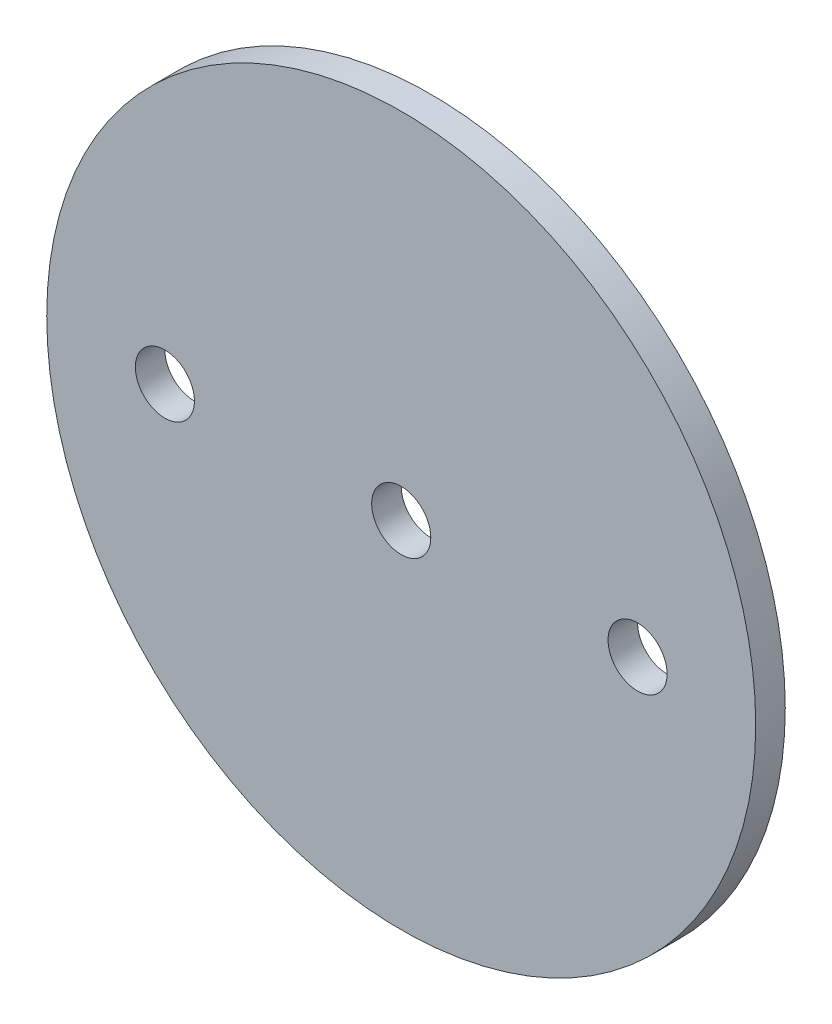
ISO-10303-21;
HEADER;
FILE_DESCRIPTION(('STEP AP214'),'2;1');
FILE_NAME('part.step','',(''),(''),'','','');
FILE_SCHEMA(('AUTOMOTIVE_DESIGN { 1 0 10303 214 1 1 1 1 }'));
ENDSEC;
DATA;
#1=APPLICATION_CONTEXT('core data for automotive mechanical design processes');
#2=APPLICATION_PROTOCOL_DEFINITION('international standard','automotive_design',2000,#1);
#3=PRODUCT_CONTEXT('',#1,'mechanical');
#4=PRODUCT('Part','Part','',(#3));
#5=PRODUCT_RELATED_PRODUCT_CATEGORY('part','',(#4));
#6=PRODUCT_DEFINITION_FORMATION('','',#4);
#7=PRODUCT_DEFINITION_CONTEXT('part definition',#1,'design');
#8=PRODUCT_DEFINITION('design','',#6,#7);
#9=PRODUCT_DEFINITION_SHAPE('','',#8);
#10=(LENGTH_UNIT() NAMED_UNIT(*) SI_UNIT(.MILLI.,.METRE.));
#11=(NAMED_UNIT(*) PLANE_ANGLE_UNIT() SI_UNIT($,.RADIAN.));
#12=(NAMED_UNIT(*) SI_UNIT($,.STERADIAN.) SOLID_ANGLE_UNIT());
#13=UNCERTAINTY_MEASURE_WITH_UNIT(LENGTH_MEASURE(1.E-05),#10,'distance_accuracy_value','');
#14=(GEOMETRIC_REPRESENTATION_CONTEXT(3) GLOBAL_UNCERTAINTY_ASSIGNED_CONTEXT((#13)) GLOBAL_UNIT_ASSIGNED_CONTEXT((#10,
#11,#12)) REPRESENTATION_CONTEXT('',''));
#15=CARTESIAN_POINT('',(0.,0.,0.));
#16=DIRECTION('',(0.,0.,1.));
#17=DIRECTION('',(1.,0.,0.));
#18=AXIS2_PLACEMENT_3D('',#15,#16,#17);
#19=CARTESIAN_POINT('',(0.,0.,1.5875));
#20=DIRECTION('',(0.,0.,-1.));
#21=DIRECTION('',(-1.,0.,0.));
#22=AXIS2_PLACEMENT_3D('',#19,#20,#21);
#23=CYLINDRICAL_SURFACE('',#22,38.1);
#24=CARTESIAN_POINT('',(0.,0.,1.5875));
#25=DIRECTION('',(0.,0.,1.));
#26=DIRECTION('',(1.,0.,0.));
#27=AXIS2_PLACEMENT_3D('',#24,#25,#26);
#28=CIRCLE('',#27,38.1);
#29=CARTESIAN_POINT('',(38.1,0.,1.5875));
#30=VERTEX_POINT('',#29);
#31=EDGE_CURVE('E10',#30,#30,#28,.T.);
#32=ORIENTED_EDGE('',*,*,#31,.F.);
#33=EDGE_LOOP('',(#32));
#34=FACE_BOUND('',#33,.T.);
#35=CARTESIAN_POINT('',(0.,0.,-1.5875));
#36=DIRECTION('',(0.,0.,1.));
#37=DIRECTION('',(1.,0.,0.));
#38=AXIS2_PLACEMENT_3D('',#35,#36,#37);
#39=CIRCLE('',#38,38.1);
#40=CARTESIAN_POINT('',(38.1,0.,-1.5875));
#41=VERTEX_POINT('',#40);
#42=EDGE_CURVE('E40',#41,#41,#39,.T.);
#43=ORIENTED_EDGE('',*,*,#42,.T.);
#44=EDGE_LOOP('',(#43));
#45=FACE_BOUND('',#44,.T.);
#46=ADVANCED_FACE('F37',(#34,#45),#23,.T.);
#47=CARTESIAN_POINT('',(0.,0.,1.5875));
#48=DIRECTION('',(0.,0.,1.));
#49=DIRECTION('',(1.,0.,0.));
#50=AXIS2_PLACEMENT_3D('',#47,#48,#49);
#51=PLANE('',#50);
#52=CARTESIAN_POINT('',(0.,0.,1.5875));
#53=DIRECTION('',(0.,0.,1.));
#54=DIRECTION('',(1.,0.,0.));
#55=AXIS2_PLACEMENT_3D('',#52,#53,#54);
#56=CIRCLE('',#55,3.17499999999999);
#57=CARTESIAN_POINT('',(3.17499999999999,0.,1.5875));
#58=VERTEX_POINT('',#57);
#59=EDGE_CURVE('E63',#58,#58,#56,.T.);
#60=ORIENTED_EDGE('',*,*,#59,.F.);
#61=EDGE_LOOP('',(#60));
#62=FACE_BOUND('',#61,.T.);
#63=CARTESIAN_POINT('',(25.4,0.,1.5875));
#64=DIRECTION('',(0.,0.,1.));
#65=DIRECTION('',(1.,0.,0.));
#66=AXIS2_PLACEMENT_3D('',#63,#64,#65);
#67=CIRCLE('',#66,3.17499999999999);
#68=CARTESIAN_POINT('',(28.575,0.,1.5875));
#69=VERTEX_POINT('',#68);
#70=EDGE_CURVE('E57',#69,#69,#67,.T.);
#71=ORIENTED_EDGE('',*,*,#70,.F.);
#72=EDGE_LOOP('',(#71));
#73=FACE_BOUND('',#72,.T.);
#74=CARTESIAN_POINT('',(-25.4,0.,1.5875));
#75=DIRECTION('',(0.,0.,1.));
#76=DIRECTION('',(1.,0.,0.));
#77=AXIS2_PLACEMENT_3D('',#74,#75,#76);
#78=CIRCLE('',#77,3.17499999999999);
#79=CARTESIAN_POINT('',(-22.225,0.,1.5875));
#80=VERTEX_POINT('',#79);
#81=EDGE_CURVE('E51',#80,#80,#78,.T.);
#82=ORIENTED_EDGE('',*,*,#81,.F.);
#83=EDGE_LOOP('',(#82));
#84=FACE_BOUND('',#83,.T.);
#85=ORIENTED_EDGE('',*,*,#31,.T.);
#86=EDGE_LOOP('',(#85));
#87=FACE_BOUND('',#86,.T.);
#88=ADVANCED_FACE('F69',(#62,#73,#84,#87),#51,.T.);
#89=CARTESIAN_POINT('',(0.,0.,-1.5875));
#90=DIRECTION('',(0.,0.,1.));
#91=DIRECTION('',(1.,0.,0.));
#92=AXIS2_PLACEMENT_3D('',#89,#90,#91);
#93=PLANE('',#92);
#94=CARTESIAN_POINT('',(0.,0.,-1.5875));
#95=DIRECTION('',(0.,0.,1.));
#96=DIRECTION('',(1.,0.,0.));
#97=AXIS2_PLACEMENT_3D('',#94,#95,#96);
#98=CIRCLE('',#97,3.17499999999999);
#99=CARTESIAN_POINT('',(3.17499999999999,0.,-1.5875));
#100=VERTEX_POINT('',#99);
#101=EDGE_CURVE('E60',#100,#100,#98,.T.);
#102=ORIENTED_EDGE('',*,*,#101,.T.);
#103=EDGE_LOOP('',(#102));
#104=FACE_BOUND('',#103,.T.);
#105=CARTESIAN_POINT('',(25.4,0.,-1.5875));
#106=DIRECTION('',(0.,0.,1.));
#107=DIRECTION('',(1.,0.,0.));
#108=AXIS2_PLACEMENT_3D('',#105,#106,#107);
#109=CIRCLE('',#108,3.17499999999999);
#110=CARTESIAN_POINT('',(28.575,0.,-1.5875));
#111=VERTEX_POINT('',#110);
#112=EDGE_CURVE('E54',#111,#111,#109,.T.);
#113=ORIENTED_EDGE('',*,*,#112,.T.);
#114=EDGE_LOOP('',(#113));
#115=FACE_BOUND('',#114,.T.);
#116=CARTESIAN_POINT('',(-25.4,0.,-1.5875));
#117=DIRECTION('',(0.,0.,1.));
#118=DIRECTION('',(1.,0.,0.));
#119=AXIS2_PLACEMENT_3D('',#116,#117,#118);
#120=CIRCLE('',#119,3.17499999999999);
#121=CARTESIAN_POINT('',(-22.225,0.,-1.5875));
#122=VERTEX_POINT('',#121);
#123=EDGE_CURVE('E47',#122,#122,#120,.T.);
#124=ORIENTED_EDGE('',*,*,#123,.T.);
#125=EDGE_LOOP('',(#124));
#126=FACE_BOUND('',#125,.T.);
#127=ORIENTED_EDGE('',*,*,#42,.F.);
#128=EDGE_LOOP('',(#127));
#129=FACE_BOUND('',#128,.T.);
#130=ADVANCED_FACE('F72',(#104,#115,#126,#129),#93,.F.);
#131=CARTESIAN_POINT('',(-25.4,0.,1.5875));
#132=DIRECTION('',(0.,0.,1.));
#133=DIRECTION('',(1.,0.,0.));
#134=AXIS2_PLACEMENT_3D('',#131,#132,#133);
#135=CYLINDRICAL_SURFACE('',#134,3.17499999999999);
#136=ORIENTED_EDGE('',*,*,#123,.F.);
#137=EDGE_LOOP('',(#136));
#138=FACE_BOUND('',#137,.T.);
#139=ORIENTED_EDGE('',*,*,#81,.T.);
#140=EDGE_LOOP('',(#139));
#141=FACE_BOUND('',#140,.T.);
#142=ADVANCED_FACE('F78',(#138,#141),#135,.F.);
#143=CARTESIAN_POINT('',(25.4,0.,1.5875));
#144=DIRECTION('',(0.,0.,1.));
#145=DIRECTION('',(1.,0.,0.));
#146=AXIS2_PLACEMENT_3D('',#143,#144,#145);
#147=CYLINDRICAL_SURFACE('',#146,3.17499999999999);
#148=ORIENTED_EDGE('',*,*,#112,.F.);
#149=EDGE_LOOP('',(#148));
#150=FACE_BOUND('',#149,.T.);
#151=ORIENTED_EDGE('',*,*,#70,.T.);
#152=EDGE_LOOP('',(#151));
#153=FACE_BOUND('',#152,.T.);
#154=ADVANCED_FACE('F80',(#150,#153),#147,.F.);
#155=CARTESIAN_POINT('',(0.,0.,1.5875));
#156=DIRECTION('',(0.,0.,1.));
#157=DIRECTION('',(1.,0.,0.));
#158=AXIS2_PLACEMENT_3D('',#155,#156,#157);
#159=CYLINDRICAL_SURFACE('',#158,3.17499999999999);
#160=ORIENTED_EDGE('',*,*,#101,.F.);
#161=EDGE_LOOP('',(#160));
#162=FACE_BOUND('',#161,.T.);
#163=ORIENTED_EDGE('',*,*,#59,.T.);
#164=EDGE_LOOP('',(#163));
#165=FACE_BOUND('',#164,.T.);
#166=ADVANCED_FACE('F67',(#162,#165),#159,.F.);
#167=CLOSED_SHELL('',(#46,#88,#130,#142,#154,#166));
#168=MANIFOLD_SOLID_BREP('B2',#167);
#169=ADVANCED_BREP_SHAPE_REPRESENTATION('',(#18,#168),#14);
#170=SHAPE_DEFINITION_REPRESENTATION(#9,#169);
ENDSEC;
END-ISO-10303-21;
